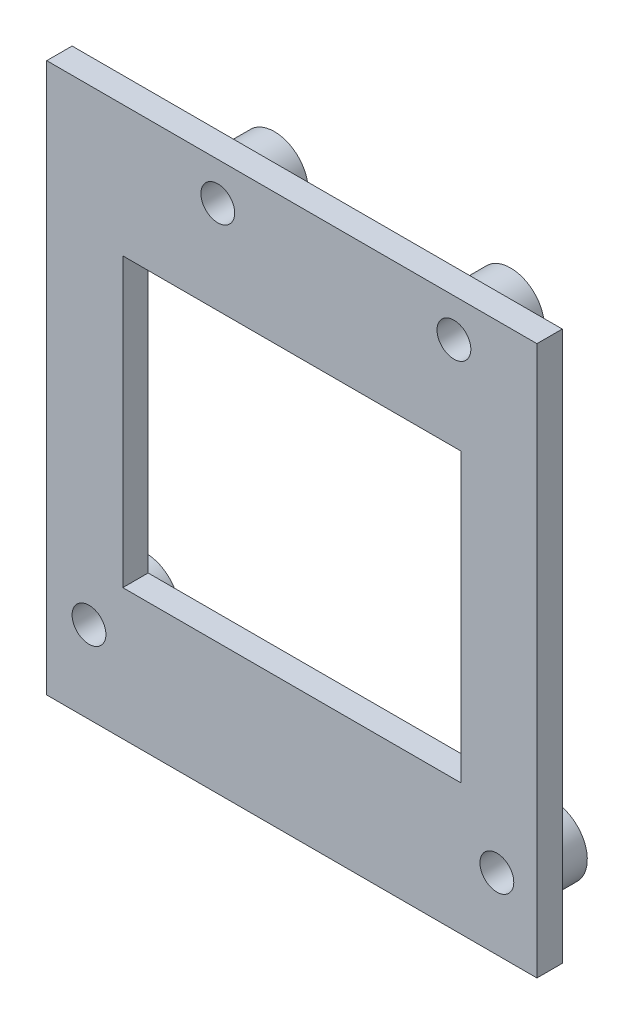
ISO-10303-21;
HEADER;
FILE_DESCRIPTION(('STEP AP214'),'2;1');
FILE_NAME('part.step','',(''),(''),'','','');
FILE_SCHEMA(('AUTOMOTIVE_DESIGN { 1 0 10303 214 1 1 1 1 }'));
ENDSEC;
DATA;
#1=APPLICATION_CONTEXT('core data for automotive mechanical design processes');
#2=APPLICATION_PROTOCOL_DEFINITION('international standard','automotive_design',2000,#1);
#3=PRODUCT_CONTEXT('',#1,'mechanical');
#4=PRODUCT('Part','Part','',(#3));
#5=PRODUCT_RELATED_PRODUCT_CATEGORY('part','',(#4));
#6=PRODUCT_DEFINITION_FORMATION('','',#4);
#7=PRODUCT_DEFINITION_CONTEXT('part definition',#1,'design');
#8=PRODUCT_DEFINITION('design','',#6,#7);
#9=PRODUCT_DEFINITION_SHAPE('','',#8);
#10=(LENGTH_UNIT() NAMED_UNIT(*) SI_UNIT(.MILLI.,.METRE.));
#11=(NAMED_UNIT(*) PLANE_ANGLE_UNIT() SI_UNIT($,.RADIAN.));
#12=(NAMED_UNIT(*) SI_UNIT($,.STERADIAN.) SOLID_ANGLE_UNIT());
#13=UNCERTAINTY_MEASURE_WITH_UNIT(LENGTH_MEASURE(1.E-05),#10,'distance_accuracy_value','');
#14=(GEOMETRIC_REPRESENTATION_CONTEXT(3) GLOBAL_UNCERTAINTY_ASSIGNED_CONTEXT((#13)) GLOBAL_UNIT_ASSIGNED_CONTEXT((#10,
#11,#12)) REPRESENTATION_CONTEXT('',''));
#15=CARTESIAN_POINT('',(0.,0.,0.));
#16=DIRECTION('',(0.,0.,1.));
#17=DIRECTION('',(1.,0.,0.));
#18=AXIS2_PLACEMENT_3D('',#15,#16,#17);
#19=CARTESIAN_POINT('',(17.,21.25,-3.001));
#20=DIRECTION('',(0.,0.,1.));
#21=DIRECTION('',(1.,0.,0.));
#22=AXIS2_PLACEMENT_3D('',#19,#20,#21);
#23=CYLINDRICAL_SURFACE('',#22,2.);
#24=CARTESIAN_POINT('',(17.,21.25,-6.7));
#25=DIRECTION('',(0.,0.,-1.));
#26=DIRECTION('',(-1.,0.,0.));
#27=AXIS2_PLACEMENT_3D('',#24,#25,#26);
#28=CIRCLE('',#27,2.);
#29=CARTESIAN_POINT('',(15.,21.25,-6.7));
#30=VERTEX_POINT('',#29);
#31=EDGE_CURVE('E379',#30,#30,#28,.T.);
#32=ORIENTED_EDGE('',*,*,#31,.T.);
#33=EDGE_LOOP('',(#32));
#34=FACE_BOUND('',#33,.T.);
#35=CARTESIAN_POINT('',(17.,21.25,-1.));
#36=DIRECTION('',(0.,0.,1.));
#37=DIRECTION('',(1.,0.,0.));
#38=AXIS2_PLACEMENT_3D('',#35,#36,#37);
#39=CIRCLE('',#38,2.);
#40=CARTESIAN_POINT('',(19.,21.25,-1.));
#41=VERTEX_POINT('',#40);
#42=EDGE_CURVE('E12',#41,#41,#39,.F.);
#43=ORIENTED_EDGE('',*,*,#42,.F.);
#44=EDGE_LOOP('',(#43));
#45=FACE_BOUND('',#44,.T.);
#46=ADVANCED_FACE('F42',(#34,#45),#23,.F.);
#47=CARTESIAN_POINT('',(17.,-26.25,-3.001));
#48=DIRECTION('',(0.,0.,1.));
#49=DIRECTION('',(1.,0.,0.));
#50=AXIS2_PLACEMENT_3D('',#47,#48,#49);
#51=CYLINDRICAL_SURFACE('',#50,2.);
#52=CARTESIAN_POINT('',(17.,-26.25,-6.7));
#53=DIRECTION('',(0.,0.,-1.));
#54=DIRECTION('',(-1.,0.,0.));
#55=AXIS2_PLACEMENT_3D('',#52,#53,#54);
#56=CIRCLE('',#55,2.);
#57=CARTESIAN_POINT('',(15.,-26.25,-6.7));
#58=VERTEX_POINT('',#57);
#59=EDGE_CURVE('E344',#58,#58,#56,.T.);
#60=ORIENTED_EDGE('',*,*,#59,.T.);
#61=EDGE_LOOP('',(#60));
#62=FACE_BOUND('',#61,.T.);
#63=CARTESIAN_POINT('',(17.,-26.25,-1.));
#64=DIRECTION('',(0.,0.,1.));
#65=DIRECTION('',(1.,0.,0.));
#66=AXIS2_PLACEMENT_3D('',#63,#64,#65);
#67=CIRCLE('',#66,2.);
#68=CARTESIAN_POINT('',(19.,-26.25,-1.));
#69=VERTEX_POINT('',#68);
#70=EDGE_CURVE('E50',#69,#69,#67,.F.);
#71=ORIENTED_EDGE('',*,*,#70,.F.);
#72=EDGE_LOOP('',(#71));
#73=FACE_BOUND('',#72,.T.);
#74=ADVANCED_FACE('F263',(#62,#73),#51,.F.);
#75=CARTESIAN_POINT('',(0.,-26.25,-3.001));
#76=DIRECTION('',(0.,0.,1.));
#77=DIRECTION('',(1.,0.,0.));
#78=AXIS2_PLACEMENT_3D('',#75,#76,#77);
#79=CYLINDRICAL_SURFACE('',#78,2.);
#80=CARTESIAN_POINT('',(0.,-26.25,-6.7));
#81=DIRECTION('',(0.,0.,-1.));
#82=DIRECTION('',(-1.,0.,0.));
#83=AXIS2_PLACEMENT_3D('',#80,#81,#82);
#84=CIRCLE('',#83,2.);
#85=CARTESIAN_POINT('',(-2.00000000000001,-26.25,-6.7));
#86=VERTEX_POINT('',#85);
#87=EDGE_CURVE('E349',#86,#86,#84,.T.);
#88=ORIENTED_EDGE('',*,*,#87,.T.);
#89=EDGE_LOOP('',(#88));
#90=FACE_BOUND('',#89,.T.);
#91=CARTESIAN_POINT('',(0.,-26.25,-1.));
#92=DIRECTION('',(0.,0.,1.));
#93=DIRECTION('',(1.,0.,0.));
#94=AXIS2_PLACEMENT_3D('',#91,#92,#93);
#95=CIRCLE('',#94,2.);
#96=CARTESIAN_POINT('',(1.99999999999999,-26.25,-1.));
#97=VERTEX_POINT('',#96);
#98=EDGE_CURVE('E256',#97,#97,#95,.F.);
#99=ORIENTED_EDGE('',*,*,#98,.F.);
#100=EDGE_LOOP('',(#99));
#101=FACE_BOUND('',#100,.T.);
#102=ADVANCED_FACE('F265',(#90,#101),#79,.F.);
#103=CARTESIAN_POINT('',(0.,21.25,-3.001));
#104=DIRECTION('',(0.,0.,1.));
#105=DIRECTION('',(1.,0.,0.));
#106=AXIS2_PLACEMENT_3D('',#103,#104,#105);
#107=CYLINDRICAL_SURFACE('',#106,2.);
#108=CARTESIAN_POINT('',(0.,21.25,-6.7));
#109=DIRECTION('',(0.,0.,-1.));
#110=DIRECTION('',(-1.,0.,0.));
#111=AXIS2_PLACEMENT_3D('',#108,#109,#110);
#112=CIRCLE('',#111,2.);
#113=CARTESIAN_POINT('',(-2.,21.25,-6.7));
#114=VERTEX_POINT('',#113);
#115=EDGE_CURVE('E373',#114,#114,#112,.T.);
#116=ORIENTED_EDGE('',*,*,#115,.T.);
#117=EDGE_LOOP('',(#116));
#118=FACE_BOUND('',#117,.T.);
#119=CARTESIAN_POINT('',(0.,21.25,-1.));
#120=DIRECTION('',(0.,0.,1.));
#121=DIRECTION('',(1.,0.,0.));
#122=AXIS2_PLACEMENT_3D('',#119,#120,#121);
#123=CIRCLE('',#122,2.);
#124=CARTESIAN_POINT('',(2.,21.25,-1.));
#125=VERTEX_POINT('',#124);
#126=EDGE_CURVE('E253',#125,#125,#123,.F.);
#127=ORIENTED_EDGE('',*,*,#126,.F.);
#128=EDGE_LOOP('',(#127));
#129=FACE_BOUND('',#128,.T.);
#130=ADVANCED_FACE('F272',(#118,#129),#107,.F.);
#131=CARTESIAN_POINT('',(-17.,-26.25,-3.001));
#132=DIRECTION('',(0.,0.,1.));
#133=DIRECTION('',(1.,0.,0.));
#134=AXIS2_PLACEMENT_3D('',#131,#132,#133);
#135=CYLINDRICAL_SURFACE('',#134,2.);
#136=CARTESIAN_POINT('',(-17.,-26.25,-6.7));
#137=DIRECTION('',(0.,0.,-1.));
#138=DIRECTION('',(-1.,0.,0.));
#139=AXIS2_PLACEMENT_3D('',#136,#137,#138);
#140=CIRCLE('',#139,2.);
#141=CARTESIAN_POINT('',(-19.,-26.25,-6.7));
#142=VERTEX_POINT('',#141);
#143=EDGE_CURVE('E355',#142,#142,#140,.T.);
#144=ORIENTED_EDGE('',*,*,#143,.T.);
#145=EDGE_LOOP('',(#144));
#146=FACE_BOUND('',#145,.T.);
#147=CARTESIAN_POINT('',(-17.,-26.25,-1.));
#148=DIRECTION('',(0.,0.,1.));
#149=DIRECTION('',(1.,0.,0.));
#150=AXIS2_PLACEMENT_3D('',#147,#148,#149);
#151=CIRCLE('',#150,2.);
#152=CARTESIAN_POINT('',(-15.,-26.25,-1.));
#153=VERTEX_POINT('',#152);
#154=EDGE_CURVE('E250',#153,#153,#151,.F.);
#155=ORIENTED_EDGE('',*,*,#154,.F.);
#156=EDGE_LOOP('',(#155));
#157=FACE_BOUND('',#156,.T.);
#158=ADVANCED_FACE('F281',(#146,#157),#135,.F.);
#159=CARTESIAN_POINT('',(-17.,21.25,-3.001));
#160=DIRECTION('',(0.,0.,1.));
#161=DIRECTION('',(1.,0.,0.));
#162=AXIS2_PLACEMENT_3D('',#159,#160,#161);
#163=CYLINDRICAL_SURFACE('',#162,2.);
#164=CARTESIAN_POINT('',(-17.,21.25,-6.7));
#165=DIRECTION('',(0.,0.,-1.));
#166=DIRECTION('',(-1.,0.,0.));
#167=AXIS2_PLACEMENT_3D('',#164,#165,#166);
#168=CIRCLE('',#167,2.);
#169=CARTESIAN_POINT('',(-19.,21.25,-6.7));
#170=VERTEX_POINT('',#169);
#171=EDGE_CURVE('E367',#170,#170,#168,.T.);
#172=ORIENTED_EDGE('',*,*,#171,.T.);
#173=EDGE_LOOP('',(#172));
#174=FACE_BOUND('',#173,.T.);
#175=CARTESIAN_POINT('',(-17.,21.25,-1.));
#176=DIRECTION('',(0.,0.,1.));
#177=DIRECTION('',(1.,0.,0.));
#178=AXIS2_PLACEMENT_3D('',#175,#176,#177);
#179=CIRCLE('',#178,2.);
#180=CARTESIAN_POINT('',(-15.,21.25,-1.));
#181=VERTEX_POINT('',#180);
#182=EDGE_CURVE('E247',#181,#181,#179,.F.);
#183=ORIENTED_EDGE('',*,*,#182,.F.);
#184=EDGE_LOOP('',(#183));
#185=FACE_BOUND('',#184,.T.);
#186=ADVANCED_FACE('F284',(#174,#185),#163,.F.);
#187=CARTESIAN_POINT('',(0.,0.,-3.));
#188=DIRECTION('',(0.,0.,1.));
#189=DIRECTION('',(1.,0.,0.));
#190=AXIS2_PLACEMENT_3D('',#187,#188,#189);
#191=PLANE('',#190);
#192=CARTESIAN_POINT('',(0.,-26.25,-3.));
#193=DIRECTION('',(0.,0.,1.));
#194=DIRECTION('',(1.,0.,0.));
#195=AXIS2_PLACEMENT_3D('',#192,#193,#194);
#196=CIRCLE('',#195,4.);
#197=CARTESIAN_POINT('',(3.99999999999999,-26.25,-3.));
#198=VERTEX_POINT('',#197);
#199=EDGE_CURVE('E244',#198,#198,#196,.F.);
#200=ORIENTED_EDGE('',*,*,#199,.F.);
#201=EDGE_LOOP('',(#200));
#202=FACE_BOUND('',#201,.T.);
#203=CARTESIAN_POINT('',(-17.,21.25,-3.));
#204=DIRECTION('',(0.,0.,1.));
#205=DIRECTION('',(1.,0.,0.));
#206=AXIS2_PLACEMENT_3D('',#203,#204,#205);
#207=CIRCLE('',#206,4.);
#208=CARTESIAN_POINT('',(-13.,21.25,-3.));
#209=VERTEX_POINT('',#208);
#210=EDGE_CURVE('E241',#209,#209,#207,.F.);
#211=ORIENTED_EDGE('',*,*,#210,.F.);
#212=EDGE_LOOP('',(#211));
#213=FACE_BOUND('',#212,.T.);
#214=CARTESIAN_POINT('',(17.,21.25,-3.));
#215=DIRECTION('',(0.,0.,-1.));
#216=DIRECTION('',(-1.,0.,0.));
#217=AXIS2_PLACEMENT_3D('',#214,#215,#216);
#218=CIRCLE('',#217,4.);
#219=CARTESIAN_POINT('',(19.8501490997706,24.0565370314815,-3.));
#220=VERTEX_POINT('',#219);
#221=CARTESIAN_POINT('',(16.3298509002294,25.1934629685185,-3.));
#222=VERTEX_POINT('',#221);
#223=EDGE_CURVE('E382',#220,#222,#218,.T.);
#224=ORIENTED_EDGE('',*,*,#223,.F.);
#225=CARTESIAN_POINT('',(19.18,28.,-3.));
#226=DIRECTION('',(0.,0.,1.));
#227=DIRECTION('',(1.,0.,0.));
#228=AXIS2_PLACEMENT_3D('',#225,#226,#227);
#229=CIRCLE('',#228,4.);
#230=EDGE_CURVE('E185',#220,#222,#229,.T.);
#231=ORIENTED_EDGE('',*,*,#230,.T.);
#232=EDGE_LOOP('',(#224,#231));
#233=FACE_BOUND('',#232,.T.);
#234=DIRECTION('',(-1.,0.,0.));
#235=VECTOR('',#234,1.);
#236=CARTESIAN_POINT('',(-20.,-17.,-3.));
#237=LINE('',#236,#235);
#238=CARTESIAN_POINT('',(20.,-17.,-3.));
#239=VERTEX_POINT('',#238);
#240=CARTESIAN_POINT('',(-20.,-17.,-3.));
#241=VERTEX_POINT('',#240);
#242=EDGE_CURVE('E395',#239,#241,#237,.T.);
#243=ORIENTED_EDGE('',*,*,#242,.F.);
#244=DIRECTION('',(0.,-1.,0.));
#245=VECTOR('',#244,1.);
#246=CARTESIAN_POINT('',(20.,17.,-3.));
#247=LINE('',#246,#245);
#248=CARTESIAN_POINT('',(20.,17.,-3.));
#249=VERTEX_POINT('',#248);
#250=EDGE_CURVE('E398',#249,#239,#247,.T.);
#251=ORIENTED_EDGE('',*,*,#250,.F.);
#252=DIRECTION('',(1.,0.,0.));
#253=VECTOR('',#252,1.);
#254=CARTESIAN_POINT('',(-20.,17.,-3.));
#255=LINE('',#254,#253);
#256=CARTESIAN_POINT('',(-20.,17.,-3.));
#257=VERTEX_POINT('',#256);
#258=EDGE_CURVE('E165',#257,#249,#255,.T.);
#259=ORIENTED_EDGE('',*,*,#258,.F.);
#260=DIRECTION('',(0.,1.,0.));
#261=VECTOR('',#260,1.);
#262=CARTESIAN_POINT('',(-20.,17.,-3.));
#263=LINE('',#262,#261);
#264=EDGE_CURVE('E393',#241,#257,#263,.T.);
#265=ORIENTED_EDGE('',*,*,#264,.F.);
#266=EDGE_LOOP('',(#243,#251,#259,#265));
#267=FACE_BOUND('',#266,.T.);
#268=CARTESIAN_POINT('',(-8.76000000000001,28.,-3.));
#269=DIRECTION('',(0.,0.,1.));
#270=DIRECTION('',(1.,0.,0.));
#271=AXIS2_PLACEMENT_3D('',#268,#269,#270);
#272=CIRCLE('',#271,4.);
#273=CARTESIAN_POINT('',(-4.76000000000001,28.,-3.));
#274=VERTEX_POINT('',#273);
#275=EDGE_CURVE('E191',#274,#274,#272,.T.);
#276=ORIENTED_EDGE('',*,*,#275,.T.);
#277=EDGE_LOOP('',(#276));
#278=FACE_BOUND('',#277,.T.);
#279=DIRECTION('',(0.,1.,0.));
#280=VECTOR('',#279,1.);
#281=CARTESIAN_POINT('',(29.,32.5,-3.));
#282=LINE('',#281,#280);
#283=CARTESIAN_POINT('',(29.,-32.5,-3.));
#284=VERTEX_POINT('',#283);
#285=CARTESIAN_POINT('',(29.,32.5,-3.));
#286=VERTEX_POINT('',#285);
#287=EDGE_CURVE('E207',#284,#286,#282,.T.);
#288=ORIENTED_EDGE('',*,*,#287,.F.);
#289=DIRECTION('',(1.,0.,0.));
#290=VECTOR('',#289,1.);
#291=CARTESIAN_POINT('',(-29.,-32.5,-3.));
#292=LINE('',#291,#290);
#293=CARTESIAN_POINT('',(-29.,-32.5,-3.));
#294=VERTEX_POINT('',#293);
#295=EDGE_CURVE('E217',#294,#284,#292,.T.);
#296=ORIENTED_EDGE('',*,*,#295,.F.);
#297=DIRECTION('',(0.,-1.,0.));
#298=VECTOR('',#297,1.);
#299=CARTESIAN_POINT('',(-29.,32.5,-3.));
#300=LINE('',#299,#298);
#301=CARTESIAN_POINT('',(-29.,32.5,-3.));
#302=VERTEX_POINT('',#301);
#303=EDGE_CURVE('E214',#302,#294,#300,.T.);
#304=ORIENTED_EDGE('',*,*,#303,.F.);
#305=DIRECTION('',(-1.,0.,0.));
#306=VECTOR('',#305,1.);
#307=CARTESIAN_POINT('',(-29.,32.5,-3.));
#308=LINE('',#307,#306);
#309=EDGE_CURVE('E210',#286,#302,#308,.T.);
#310=ORIENTED_EDGE('',*,*,#309,.F.);
#311=EDGE_LOOP('',(#288,#296,#304,#310));
#312=FACE_BOUND('',#311,.T.);
#313=CARTESIAN_POINT('',(0.,21.25,-3.));
#314=DIRECTION('',(0.,0.,1.));
#315=DIRECTION('',(1.,0.,0.));
#316=AXIS2_PLACEMENT_3D('',#313,#314,#315);
#317=CIRCLE('',#316,4.);
#318=CARTESIAN_POINT('',(4.,21.25,-3.));
#319=VERTEX_POINT('',#318);
#320=EDGE_CURVE('E233',#319,#319,#317,.F.);
#321=ORIENTED_EDGE('',*,*,#320,.F.);
#322=EDGE_LOOP('',(#321));
#323=FACE_BOUND('',#322,.T.);
#324=CARTESIAN_POINT('',(-17.,-26.25,-3.));
#325=DIRECTION('',(0.,0.,-1.));
#326=DIRECTION('',(-1.,0.,0.));
#327=AXIS2_PLACEMENT_3D('',#324,#325,#326);
#328=CIRCLE('',#327,4.);
#329=CARTESIAN_POINT('',(-20.1109752818749,-23.7356744849635,-3.));
#330=VERTEX_POINT('',#329);
#331=CARTESIAN_POINT('',(-20.8890247181251,-25.3143255150365,-3.));
#332=VERTEX_POINT('',#331);
#333=EDGE_CURVE('E65',#330,#332,#328,.T.);
#334=ORIENTED_EDGE('',*,*,#333,.F.);
#335=CARTESIAN_POINT('',(-24.,-22.8,-3.));
#336=DIRECTION('',(0.,0.,1.));
#337=DIRECTION('',(1.,0.,0.));
#338=AXIS2_PLACEMENT_3D('',#335,#336,#337);
#339=CIRCLE('',#338,4.);
#340=EDGE_CURVE('E174',#330,#332,#339,.T.);
#341=ORIENTED_EDGE('',*,*,#340,.T.);
#342=EDGE_LOOP('',(#334,#341));
#343=FACE_BOUND('',#342,.T.);
#344=CARTESIAN_POINT('',(17.,-26.25,-3.));
#345=DIRECTION('',(0.,0.,-1.));
#346=DIRECTION('',(-1.,0.,0.));
#347=AXIS2_PLACEMENT_3D('',#344,#345,#346);
#348=CIRCLE('',#347,4.);
#349=CARTESIAN_POINT('',(20.9977329631625,-26.3846519782386,-3.));
#350=VERTEX_POINT('',#349);
#351=CARTESIAN_POINT('',(20.2622670368375,-23.9353480217614,-3.));
#352=VERTEX_POINT('',#351);
#353=EDGE_CURVE('E57',#350,#352,#348,.T.);
#354=ORIENTED_EDGE('',*,*,#353,.F.);
#355=CARTESIAN_POINT('',(24.26,-24.07,-3.));
#356=DIRECTION('',(0.,0.,1.));
#357=DIRECTION('',(1.,0.,0.));
#358=AXIS2_PLACEMENT_3D('',#355,#356,#357);
#359=CIRCLE('',#358,4.);
#360=EDGE_CURVE('E180',#350,#352,#359,.T.);
#361=ORIENTED_EDGE('',*,*,#360,.T.);
#362=EDGE_LOOP('',(#354,#361));
#363=FACE_BOUND('',#362,.T.);
#364=ADVANCED_FACE('F287',(#202,#213,#233,#267,#278,#312,#323,#343,#363),#191,.F.);
#365=CARTESIAN_POINT('',(24.26,-24.07,-5.7));
#366=DIRECTION('',(0.,0.,1.));
#367=DIRECTION('',(1.,0.,0.));
#368=AXIS2_PLACEMENT_3D('',#365,#366,#367);
#369=CYLINDRICAL_SURFACE('',#368,4.);
#370=ORIENTED_EDGE('',*,*,#360,.F.);
#371=DIRECTION('',(0.,0.,1.));
#372=VECTOR('',#371,1.);
#373=CARTESIAN_POINT('',(20.9977329631625,-26.3846519782386,-4.85));
#374=LINE('',#373,#372);
#375=CARTESIAN_POINT('',(20.9977329631625,-26.3846519782386,-6.7));
#376=VERTEX_POINT('',#375);
#377=EDGE_CURVE('E149',#350,#376,#374,.F.);
#378=ORIENTED_EDGE('',*,*,#377,.T.);
#379=CARTESIAN_POINT('',(24.26,-24.07,-6.7));
#380=DIRECTION('',(0.,0.,-1.));
#381=DIRECTION('',(-1.,0.,0.));
#382=AXIS2_PLACEMENT_3D('',#379,#380,#381);
#383=CIRCLE('',#382,4.);
#384=CARTESIAN_POINT('',(20.2622670368375,-23.9353480217614,-6.7));
#385=VERTEX_POINT('',#384);
#386=EDGE_CURVE('E155',#385,#376,#383,.T.);
#387=ORIENTED_EDGE('',*,*,#386,.F.);
#388=DIRECTION('',(0.,0.,1.));
#389=VECTOR('',#388,1.);
#390=CARTESIAN_POINT('',(20.2622670368375,-23.9353480217614,-4.85));
#391=LINE('',#390,#389);
#392=EDGE_CURVE('E140',#385,#352,#391,.T.);
#393=ORIENTED_EDGE('',*,*,#392,.T.);
#394=EDGE_LOOP('',(#370,#378,#387,#393));
#395=FACE_BOUND('',#394,.T.);
#396=ADVANCED_FACE('F157',(#395),#369,.T.);
#397=CARTESIAN_POINT('',(-24.,-22.8,-5.7));
#398=DIRECTION('',(0.,0.,1.));
#399=DIRECTION('',(1.,0.,0.));
#400=AXIS2_PLACEMENT_3D('',#397,#398,#399);
#401=CYLINDRICAL_SURFACE('',#400,4.);
#402=ORIENTED_EDGE('',*,*,#340,.F.);
#403=DIRECTION('',(0.,0.,1.));
#404=VECTOR('',#403,1.);
#405=CARTESIAN_POINT('',(-20.1109752818749,-23.7356744849635,-4.85));
#406=LINE('',#405,#404);
#407=CARTESIAN_POINT('',(-20.1109752818749,-23.7356744849635,-6.7));
#408=VERTEX_POINT('',#407);
#409=EDGE_CURVE('E364',#330,#408,#406,.F.);
#410=ORIENTED_EDGE('',*,*,#409,.T.);
#411=CARTESIAN_POINT('',(-24.,-22.8,-6.7));
#412=DIRECTION('',(0.,0.,-1.));
#413=DIRECTION('',(-1.,0.,0.));
#414=AXIS2_PLACEMENT_3D('',#411,#412,#413);
#415=CIRCLE('',#414,4.);
#416=CARTESIAN_POINT('',(-20.8890247181251,-25.3143255150365,-6.7));
#417=VERTEX_POINT('',#416);
#418=EDGE_CURVE('E162',#417,#408,#415,.T.);
#419=ORIENTED_EDGE('',*,*,#418,.F.);
#420=DIRECTION('',(0.,0.,1.));
#421=VECTOR('',#420,1.);
#422=CARTESIAN_POINT('',(-20.8890247181251,-25.3143255150365,-4.85));
#423=LINE('',#422,#421);
#424=EDGE_CURVE('E361',#417,#332,#423,.T.);
#425=ORIENTED_EDGE('',*,*,#424,.T.);
#426=EDGE_LOOP('',(#402,#410,#419,#425));
#427=FACE_BOUND('',#426,.T.);
#428=ADVANCED_FACE('F485',(#427),#401,.T.);
#429=CARTESIAN_POINT('',(19.18,28.,-5.7));
#430=DIRECTION('',(0.,0.,1.));
#431=DIRECTION('',(1.,0.,0.));
#432=AXIS2_PLACEMENT_3D('',#429,#430,#431);
#433=CYLINDRICAL_SURFACE('',#432,4.);
#434=ORIENTED_EDGE('',*,*,#230,.F.);
#435=DIRECTION('',(0.,0.,1.));
#436=VECTOR('',#435,1.);
#437=CARTESIAN_POINT('',(19.8501490997706,24.0565370314815,-4.85));
#438=LINE('',#437,#436);
#439=CARTESIAN_POINT('',(19.8501490997706,24.0565370314815,-6.7));
#440=VERTEX_POINT('',#439);
#441=EDGE_CURVE('E390',#220,#440,#438,.F.);
#442=ORIENTED_EDGE('',*,*,#441,.T.);
#443=CARTESIAN_POINT('',(19.18,28.,-6.7));
#444=DIRECTION('',(0.,0.,-1.));
#445=DIRECTION('',(-1.,0.,0.));
#446=AXIS2_PLACEMENT_3D('',#443,#444,#445);
#447=CIRCLE('',#446,4.);
#448=CARTESIAN_POINT('',(16.3298509002294,25.1934629685185,-6.7));
#449=VERTEX_POINT('',#448);
#450=EDGE_CURVE('E159',#449,#440,#447,.T.);
#451=ORIENTED_EDGE('',*,*,#450,.F.);
#452=DIRECTION('',(0.,0.,1.));
#453=VECTOR('',#452,1.);
#454=CARTESIAN_POINT('',(16.3298509002294,25.1934629685185,-4.85));
#455=LINE('',#454,#453);
#456=EDGE_CURVE('E386',#449,#222,#455,.T.);
#457=ORIENTED_EDGE('',*,*,#456,.T.);
#458=EDGE_LOOP('',(#434,#442,#451,#457));
#459=FACE_BOUND('',#458,.T.);
#460=ADVANCED_FACE('F488',(#459),#433,.T.);
#461=CARTESIAN_POINT('',(29.,32.5,-3.));
#462=DIRECTION('',(1.,0.,0.));
#463=DIRECTION('',(0.,1.,0.));
#464=AXIS2_PLACEMENT_3D('',#461,#462,#463);
#465=PLANE('',#464);
#466=DIRECTION('',(0.,1.,0.));
#467=VECTOR('',#466,1.);
#468=CARTESIAN_POINT('',(29.,32.5,0.));
#469=LINE('',#468,#467);
#470=CARTESIAN_POINT('',(29.,-32.5,0.));
#471=VERTEX_POINT('',#470);
#472=CARTESIAN_POINT('',(29.,32.5,0.));
#473=VERTEX_POINT('',#472);
#474=EDGE_CURVE('E206',#471,#473,#469,.T.);
#475=ORIENTED_EDGE('',*,*,#474,.F.);
#476=DIRECTION('',(0.,0.,1.));
#477=VECTOR('',#476,1.);
#478=CARTESIAN_POINT('',(29.,-32.5,-3.));
#479=LINE('',#478,#477);
#480=EDGE_CURVE('E231',#284,#471,#479,.T.);
#481=ORIENTED_EDGE('',*,*,#480,.F.);
#482=ORIENTED_EDGE('',*,*,#287,.T.);
#483=DIRECTION('',(0.,0.,1.));
#484=VECTOR('',#483,1.);
#485=CARTESIAN_POINT('',(29.,32.5,-3.));
#486=LINE('',#485,#484);
#487=EDGE_CURVE('E220',#286,#473,#486,.T.);
#488=ORIENTED_EDGE('',*,*,#487,.T.);
#489=EDGE_LOOP('',(#475,#481,#482,#488));
#490=FACE_BOUND('',#489,.T.);
#491=ADVANCED_FACE('F44',(#490),#465,.T.);
#492=CARTESIAN_POINT('',(-29.,-32.5,-3.));
#493=DIRECTION('',(0.,-1.,0.));
#494=DIRECTION('',(0.,0.,-1.));
#495=AXIS2_PLACEMENT_3D('',#492,#493,#494);
#496=PLANE('',#495);
#497=DIRECTION('',(1.,0.,0.));
#498=VECTOR('',#497,1.);
#499=CARTESIAN_POINT('',(-29.,-32.5,0.));
#500=LINE('',#499,#498);
#501=CARTESIAN_POINT('',(-29.,-32.5,0.));
#502=VERTEX_POINT('',#501);
#503=EDGE_CURVE('E211',#502,#471,#500,.T.);
#504=ORIENTED_EDGE('',*,*,#503,.F.);
#505=DIRECTION('',(0.,0.,1.));
#506=VECTOR('',#505,1.);
#507=CARTESIAN_POINT('',(-29.,-32.5,-3.));
#508=LINE('',#507,#506);
#509=EDGE_CURVE('E234',#294,#502,#508,.T.);
#510=ORIENTED_EDGE('',*,*,#509,.F.);
#511=ORIENTED_EDGE('',*,*,#295,.T.);
#512=ORIENTED_EDGE('',*,*,#480,.T.);
#513=EDGE_LOOP('',(#504,#510,#511,#512));
#514=FACE_BOUND('',#513,.T.);
#515=ADVANCED_FACE('F317',(#514),#496,.T.);
#516=CARTESIAN_POINT('',(-29.,32.5,-3.));
#517=DIRECTION('',(-1.,0.,0.));
#518=DIRECTION('',(0.,-1.,0.));
#519=AXIS2_PLACEMENT_3D('',#516,#517,#518);
#520=PLANE('',#519);
#521=DIRECTION('',(0.,-1.,0.));
#522=VECTOR('',#521,1.);
#523=CARTESIAN_POINT('',(-29.,32.5,0.));
#524=LINE('',#523,#522);
#525=CARTESIAN_POINT('',(-29.,32.5,0.));
#526=VERTEX_POINT('',#525);
#527=EDGE_CURVE('E226',#526,#502,#524,.T.);
#528=ORIENTED_EDGE('',*,*,#527,.F.);
#529=DIRECTION('',(0.,0.,1.));
#530=VECTOR('',#529,1.);
#531=CARTESIAN_POINT('',(-29.,32.5,-3.));
#532=LINE('',#531,#530);
#533=EDGE_CURVE('E236',#302,#526,#532,.T.);
#534=ORIENTED_EDGE('',*,*,#533,.F.);
#535=ORIENTED_EDGE('',*,*,#303,.T.);
#536=ORIENTED_EDGE('',*,*,#509,.T.);
#537=EDGE_LOOP('',(#528,#534,#535,#536));
#538=FACE_BOUND('',#537,.T.);
#539=ADVANCED_FACE('F320',(#538),#520,.T.);
#540=CARTESIAN_POINT('',(-29.,32.5,-3.));
#541=DIRECTION('',(0.,1.,0.));
#542=DIRECTION('',(0.,0.,1.));
#543=AXIS2_PLACEMENT_3D('',#540,#541,#542);
#544=PLANE('',#543);
#545=DIRECTION('',(-1.,0.,0.));
#546=VECTOR('',#545,1.);
#547=CARTESIAN_POINT('',(-29.,32.5,0.));
#548=LINE('',#547,#546);
#549=EDGE_CURVE('E223',#473,#526,#548,.T.);
#550=ORIENTED_EDGE('',*,*,#549,.F.);
#551=ORIENTED_EDGE('',*,*,#487,.F.);
#552=ORIENTED_EDGE('',*,*,#309,.T.);
#553=ORIENTED_EDGE('',*,*,#533,.T.);
#554=EDGE_LOOP('',(#550,#551,#552,#553));
#555=FACE_BOUND('',#554,.T.);
#556=ADVANCED_FACE('F315',(#555),#544,.T.);
#557=CARTESIAN_POINT('',(0.,0.,0.));
#558=DIRECTION('',(0.,0.,1.));
#559=DIRECTION('',(1.,0.,0.));
#560=AXIS2_PLACEMENT_3D('',#557,#558,#559);
#561=PLANE('',#560);
#562=DIRECTION('',(0.,1.,0.));
#563=VECTOR('',#562,1.);
#564=CARTESIAN_POINT('',(20.,17.,0.));
#565=LINE('',#564,#563);
#566=CARTESIAN_POINT('',(20.,-17.,0.));
#567=VERTEX_POINT('',#566);
#568=CARTESIAN_POINT('',(20.,17.,0.));
#569=VERTEX_POINT('',#568);
#570=EDGE_CURVE('E401',#567,#569,#565,.T.);
#571=ORIENTED_EDGE('',*,*,#570,.F.);
#572=DIRECTION('',(1.,0.,0.));
#573=VECTOR('',#572,1.);
#574=CARTESIAN_POINT('',(-20.,-17.,0.));
#575=LINE('',#574,#573);
#576=CARTESIAN_POINT('',(-20.,-17.,0.));
#577=VERTEX_POINT('',#576);
#578=EDGE_CURVE('E409',#577,#567,#575,.T.);
#579=ORIENTED_EDGE('',*,*,#578,.F.);
#580=DIRECTION('',(0.,-1.,0.));
#581=VECTOR('',#580,1.);
#582=CARTESIAN_POINT('',(-20.,17.,0.));
#583=LINE('',#582,#581);
#584=CARTESIAN_POINT('',(-20.,17.,0.));
#585=VERTEX_POINT('',#584);
#586=EDGE_CURVE('E406',#585,#577,#583,.T.);
#587=ORIENTED_EDGE('',*,*,#586,.F.);
#588=DIRECTION('',(-1.,0.,0.));
#589=VECTOR('',#588,1.);
#590=CARTESIAN_POINT('',(-20.,17.,0.));
#591=LINE('',#590,#589);
#592=EDGE_CURVE('E403',#569,#585,#591,.T.);
#593=ORIENTED_EDGE('',*,*,#592,.F.);
#594=EDGE_LOOP('',(#571,#579,#587,#593));
#595=FACE_BOUND('',#594,.T.);
#596=CARTESIAN_POINT('',(24.26,-24.07,0.));
#597=DIRECTION('',(0.,0.,1.));
#598=DIRECTION('',(1.,0.,0.));
#599=AXIS2_PLACEMENT_3D('',#596,#597,#598);
#600=CIRCLE('',#599,2.);
#601=CARTESIAN_POINT('',(26.26,-24.07,0.));
#602=VERTEX_POINT('',#601);
#603=EDGE_CURVE('E194',#602,#602,#600,.T.);
#604=ORIENTED_EDGE('',*,*,#603,.F.);
#605=EDGE_LOOP('',(#604));
#606=FACE_BOUND('',#605,.T.);
#607=CARTESIAN_POINT('',(-24.,-22.8,0.));
#608=DIRECTION('',(0.,0.,1.));
#609=DIRECTION('',(1.,0.,0.));
#610=AXIS2_PLACEMENT_3D('',#607,#608,#609);
#611=CIRCLE('',#610,2.);
#612=CARTESIAN_POINT('',(-22.,-22.8,0.));
#613=VERTEX_POINT('',#612);
#614=EDGE_CURVE('E199',#613,#613,#611,.T.);
#615=ORIENTED_EDGE('',*,*,#614,.F.);
#616=EDGE_LOOP('',(#615));
#617=FACE_BOUND('',#616,.T.);
#618=CARTESIAN_POINT('',(19.18,28.,0.));
#619=DIRECTION('',(0.,0.,1.));
#620=DIRECTION('',(1.,0.,0.));
#621=AXIS2_PLACEMENT_3D('',#618,#619,#620);
#622=CIRCLE('',#621,2.);
#623=CARTESIAN_POINT('',(21.18,28.,0.));
#624=VERTEX_POINT('',#623);
#625=EDGE_CURVE('E195',#624,#624,#622,.T.);
#626=ORIENTED_EDGE('',*,*,#625,.F.);
#627=EDGE_LOOP('',(#626));
#628=FACE_BOUND('',#627,.T.);
#629=CARTESIAN_POINT('',(-8.76000000000001,28.,0.));
#630=DIRECTION('',(0.,0.,1.));
#631=DIRECTION('',(1.,0.,0.));
#632=AXIS2_PLACEMENT_3D('',#629,#630,#631);
#633=CIRCLE('',#632,2.);
#634=CARTESIAN_POINT('',(-6.76000000000001,28.,0.));
#635=VERTEX_POINT('',#634);
#636=EDGE_CURVE('E198',#635,#635,#633,.T.);
#637=ORIENTED_EDGE('',*,*,#636,.F.);
#638=EDGE_LOOP('',(#637));
#639=FACE_BOUND('',#638,.T.);
#640=ORIENTED_EDGE('',*,*,#474,.T.);
#641=ORIENTED_EDGE('',*,*,#549,.T.);
#642=ORIENTED_EDGE('',*,*,#527,.T.);
#643=ORIENTED_EDGE('',*,*,#503,.T.);
#644=EDGE_LOOP('',(#640,#641,#642,#643));
#645=FACE_BOUND('',#644,.T.);
#646=ADVANCED_FACE('F308',(#595,#606,#617,#628,#639,#645),#561,.T.);
#647=CARTESIAN_POINT('',(-8.76000000000001,28.,-3.001));
#648=DIRECTION('',(0.,0.,1.));
#649=DIRECTION('',(1.,0.,0.));
#650=AXIS2_PLACEMENT_3D('',#647,#648,#649);
#651=CYLINDRICAL_SURFACE('',#650,2.);
#652=ORIENTED_EDGE('',*,*,#636,.T.);
#653=EDGE_LOOP('',(#652));
#654=FACE_BOUND('',#653,.T.);
#655=CARTESIAN_POINT('',(-8.76000000000001,28.,-5.7));
#656=DIRECTION('',(0.,0.,1.));
#657=DIRECTION('',(1.,0.,0.));
#658=AXIS2_PLACEMENT_3D('',#655,#656,#657);
#659=CIRCLE('',#658,2.);
#660=CARTESIAN_POINT('',(-6.76000000000001,28.,-5.7));
#661=VERTEX_POINT('',#660);
#662=EDGE_CURVE('E188',#661,#661,#659,.T.);
#663=ORIENTED_EDGE('',*,*,#662,.F.);
#664=EDGE_LOOP('',(#663));
#665=FACE_BOUND('',#664,.T.);
#666=ADVANCED_FACE('F296',(#654,#665),#651,.F.);
#667=CARTESIAN_POINT('',(19.18,28.,-3.001));
#668=DIRECTION('',(0.,0.,1.));
#669=DIRECTION('',(1.,0.,0.));
#670=AXIS2_PLACEMENT_3D('',#667,#668,#669);
#671=CYLINDRICAL_SURFACE('',#670,2.);
#672=ORIENTED_EDGE('',*,*,#625,.T.);
#673=EDGE_LOOP('',(#672));
#674=FACE_BOUND('',#673,.T.);
#675=CARTESIAN_POINT('',(19.18,28.,-5.7));
#676=DIRECTION('',(0.,0.,1.));
#677=DIRECTION('',(1.,0.,0.));
#678=AXIS2_PLACEMENT_3D('',#675,#676,#677);
#679=CIRCLE('',#678,2.);
#680=CARTESIAN_POINT('',(21.18,28.,-5.7));
#681=VERTEX_POINT('',#680);
#682=EDGE_CURVE('E182',#681,#681,#679,.T.);
#683=ORIENTED_EDGE('',*,*,#682,.F.);
#684=EDGE_LOOP('',(#683));
#685=FACE_BOUND('',#684,.T.);
#686=ADVANCED_FACE('F292',(#674,#685),#671,.F.);
#687=CARTESIAN_POINT('',(-24.,-22.8,-3.001));
#688=DIRECTION('',(0.,0.,1.));
#689=DIRECTION('',(1.,0.,0.));
#690=AXIS2_PLACEMENT_3D('',#687,#688,#689);
#691=CYLINDRICAL_SURFACE('',#690,2.);
#692=ORIENTED_EDGE('',*,*,#614,.T.);
#693=EDGE_LOOP('',(#692));
#694=FACE_BOUND('',#693,.T.);
#695=CARTESIAN_POINT('',(-24.,-22.8,-5.7));
#696=DIRECTION('',(0.,0.,1.));
#697=DIRECTION('',(1.,0.,0.));
#698=AXIS2_PLACEMENT_3D('',#695,#696,#697);
#699=CIRCLE('',#698,2.);
#700=CARTESIAN_POINT('',(-22.,-22.8,-5.7));
#701=VERTEX_POINT('',#700);
#702=EDGE_CURVE('E171',#701,#701,#699,.T.);
#703=ORIENTED_EDGE('',*,*,#702,.F.);
#704=EDGE_LOOP('',(#703));
#705=FACE_BOUND('',#704,.T.);
#706=ADVANCED_FACE('F295',(#694,#705),#691,.F.);
#707=CARTESIAN_POINT('',(24.26,-24.07,-3.001));
#708=DIRECTION('',(0.,0.,1.));
#709=DIRECTION('',(1.,0.,0.));
#710=AXIS2_PLACEMENT_3D('',#707,#708,#709);
#711=CYLINDRICAL_SURFACE('',#710,2.);
#712=ORIENTED_EDGE('',*,*,#603,.T.);
#713=EDGE_LOOP('',(#712));
#714=FACE_BOUND('',#713,.T.);
#715=CARTESIAN_POINT('',(24.26,-24.07,-5.7));
#716=DIRECTION('',(0.,0.,1.));
#717=DIRECTION('',(1.,0.,0.));
#718=AXIS2_PLACEMENT_3D('',#715,#716,#717);
#719=CIRCLE('',#718,2.);
#720=CARTESIAN_POINT('',(26.26,-24.07,-5.7));
#721=VERTEX_POINT('',#720);
#722=EDGE_CURVE('E177',#721,#721,#719,.T.);
#723=ORIENTED_EDGE('',*,*,#722,.F.);
#724=EDGE_LOOP('',(#723));
#725=FACE_BOUND('',#724,.T.);
#726=ADVANCED_FACE('F300',(#714,#725),#711,.F.);
#727=CARTESIAN_POINT('',(-8.76000000000001,28.,-5.7));
#728=DIRECTION('',(0.,0.,1.));
#729=DIRECTION('',(1.,0.,0.));
#730=AXIS2_PLACEMENT_3D('',#727,#728,#729);
#731=CYLINDRICAL_SURFACE('',#730,4.);
#732=ORIENTED_EDGE('',*,*,#275,.F.);
#733=EDGE_LOOP('',(#732));
#734=FACE_BOUND('',#733,.T.);
#735=CARTESIAN_POINT('',(-8.76000000000001,28.,-6.7));
#736=DIRECTION('',(0.,0.,-1.));
#737=DIRECTION('',(-1.,0.,0.));
#738=AXIS2_PLACEMENT_3D('',#735,#736,#737);
#739=CIRCLE('',#738,4.);
#740=CARTESIAN_POINT('',(-12.76,28.,-6.7));
#741=VERTEX_POINT('',#740);
#742=EDGE_CURVE('E158',#741,#741,#739,.T.);
#743=ORIENTED_EDGE('',*,*,#742,.F.);
#744=EDGE_LOOP('',(#743));
#745=FACE_BOUND('',#744,.T.);
#746=ADVANCED_FACE('F304',(#734,#745),#731,.T.);
#747=CARTESIAN_POINT('',(-24.,-22.8,-5.7));
#748=DIRECTION('',(0.,0.,-1.));
#749=DIRECTION('',(-1.,0.,0.));
#750=AXIS2_PLACEMENT_3D('',#747,#748,#749);
#751=PLANE('',#750);
#752=ORIENTED_EDGE('',*,*,#702,.T.);
#753=EDGE_LOOP('',(#752));
#754=FACE_BOUND('',#753,.T.);
#755=ADVANCED_FACE('F480',(#754),#751,.F.);
#756=CARTESIAN_POINT('',(-24.,-22.8,-6.7));
#757=DIRECTION('',(0.,0.,-1.));
#758=DIRECTION('',(-1.,0.,0.));
#759=AXIS2_PLACEMENT_3D('',#756,#757,#758);
#760=PLANE('',#759);
#761=ORIENTED_EDGE('',*,*,#418,.T.);
#762=CARTESIAN_POINT('',(-17.,-26.25,-6.7));
#763=DIRECTION('',(0.,0.,-1.));
#764=DIRECTION('',(-1.,0.,0.));
#765=AXIS2_PLACEMENT_3D('',#762,#763,#764);
#766=CIRCLE('',#765,4.);
#767=EDGE_CURVE('E358',#408,#417,#766,.T.);
#768=ORIENTED_EDGE('',*,*,#767,.T.);
#769=EDGE_LOOP('',(#761,#768));
#770=FACE_BOUND('',#769,.T.);
#771=ORIENTED_EDGE('',*,*,#143,.F.);
#772=EDGE_LOOP('',(#771));
#773=FACE_BOUND('',#772,.T.);
#774=ADVANCED_FACE('F476',(#770,#773),#760,.T.);
#775=CARTESIAN_POINT('',(-8.76000000000001,28.,-5.7));
#776=DIRECTION('',(0.,0.,-1.));
#777=DIRECTION('',(-1.,0.,0.));
#778=AXIS2_PLACEMENT_3D('',#775,#776,#777);
#779=PLANE('',#778);
#780=ORIENTED_EDGE('',*,*,#662,.T.);
#781=EDGE_LOOP('',(#780));
#782=FACE_BOUND('',#781,.T.);
#783=ADVANCED_FACE('F472',(#782),#779,.F.);
#784=CARTESIAN_POINT('',(-8.76000000000001,28.,-6.7));
#785=DIRECTION('',(0.,0.,-1.));
#786=DIRECTION('',(-1.,0.,0.));
#787=AXIS2_PLACEMENT_3D('',#784,#785,#786);
#788=PLANE('',#787);
#789=ORIENTED_EDGE('',*,*,#742,.T.);
#790=EDGE_LOOP('',(#789));
#791=FACE_BOUND('',#790,.T.);
#792=ADVANCED_FACE('F468',(#791),#788,.T.);
#793=CARTESIAN_POINT('',(24.26,-24.07,-5.7));
#794=DIRECTION('',(0.,0.,-1.));
#795=DIRECTION('',(-1.,0.,0.));
#796=AXIS2_PLACEMENT_3D('',#793,#794,#795);
#797=PLANE('',#796);
#798=ORIENTED_EDGE('',*,*,#722,.T.);
#799=EDGE_LOOP('',(#798));
#800=FACE_BOUND('',#799,.T.);
#801=ADVANCED_FACE('F465',(#800),#797,.F.);
#802=CARTESIAN_POINT('',(24.26,-24.07,-6.7));
#803=DIRECTION('',(0.,0.,-1.));
#804=DIRECTION('',(-1.,0.,0.));
#805=AXIS2_PLACEMENT_3D('',#802,#803,#804);
#806=PLANE('',#805);
#807=ORIENTED_EDGE('',*,*,#386,.T.);
#808=CARTESIAN_POINT('',(17.,-26.25,-6.7));
#809=DIRECTION('',(0.,0.,-1.));
#810=DIRECTION('',(-1.,0.,0.));
#811=AXIS2_PLACEMENT_3D('',#808,#809,#810);
#812=CIRCLE('',#811,4.);
#813=EDGE_CURVE('E143',#376,#385,#812,.T.);
#814=ORIENTED_EDGE('',*,*,#813,.T.);
#815=EDGE_LOOP('',(#807,#814));
#816=FACE_BOUND('',#815,.T.);
#817=ORIENTED_EDGE('',*,*,#59,.F.);
#818=EDGE_LOOP('',(#817));
#819=FACE_BOUND('',#818,.T.);
#820=ADVANCED_FACE('F153',(#816,#819),#806,.T.);
#821=CARTESIAN_POINT('',(19.18,28.,-5.7));
#822=DIRECTION('',(0.,0.,-1.));
#823=DIRECTION('',(-1.,0.,0.));
#824=AXIS2_PLACEMENT_3D('',#821,#822,#823);
#825=PLANE('',#824);
#826=ORIENTED_EDGE('',*,*,#682,.T.);
#827=EDGE_LOOP('',(#826));
#828=FACE_BOUND('',#827,.T.);
#829=ADVANCED_FACE('F458',(#828),#825,.F.);
#830=CARTESIAN_POINT('',(19.18,28.,-6.7));
#831=DIRECTION('',(0.,0.,-1.));
#832=DIRECTION('',(-1.,0.,0.));
#833=AXIS2_PLACEMENT_3D('',#830,#831,#832);
#834=PLANE('',#833);
#835=ORIENTED_EDGE('',*,*,#450,.T.);
#836=CARTESIAN_POINT('',(17.,21.25,-6.7));
#837=DIRECTION('',(0.,0.,-1.));
#838=DIRECTION('',(-1.,0.,0.));
#839=AXIS2_PLACEMENT_3D('',#836,#837,#838);
#840=CIRCLE('',#839,4.);
#841=EDGE_CURVE('E383',#440,#449,#840,.T.);
#842=ORIENTED_EDGE('',*,*,#841,.T.);
#843=EDGE_LOOP('',(#835,#842));
#844=FACE_BOUND('',#843,.T.);
#845=ORIENTED_EDGE('',*,*,#31,.F.);
#846=EDGE_LOOP('',(#845));
#847=FACE_BOUND('',#846,.T.);
#848=ADVANCED_FACE('F448',(#844,#847),#834,.T.);
#849=CARTESIAN_POINT('',(20.,17.,-6.701));
#850=DIRECTION('',(1.,0.,0.));
#851=DIRECTION('',(0.,1.,0.));
#852=AXIS2_PLACEMENT_3D('',#849,#850,#851);
#853=PLANE('',#852);
#854=ORIENTED_EDGE('',*,*,#250,.T.);
#855=DIRECTION('',(0.,0.,1.));
#856=VECTOR('',#855,1.);
#857=CARTESIAN_POINT('',(20.,-17.,-6.701));
#858=LINE('',#857,#856);
#859=EDGE_CURVE('E413',#239,#567,#858,.T.);
#860=ORIENTED_EDGE('',*,*,#859,.T.);
#861=ORIENTED_EDGE('',*,*,#570,.T.);
#862=DIRECTION('',(0.,0.,1.));
#863=VECTOR('',#862,1.);
#864=CARTESIAN_POINT('',(20.,17.,-6.701));
#865=LINE('',#864,#863);
#866=EDGE_CURVE('E412',#249,#569,#865,.T.);
#867=ORIENTED_EDGE('',*,*,#866,.F.);
#868=EDGE_LOOP('',(#854,#860,#861,#867));
#869=FACE_BOUND('',#868,.T.);
#870=ADVANCED_FACE('F432',(#869),#853,.F.);
#871=CARTESIAN_POINT('',(-20.,-17.,-6.701));
#872=DIRECTION('',(0.,-1.,0.));
#873=DIRECTION('',(0.,0.,-1.));
#874=AXIS2_PLACEMENT_3D('',#871,#872,#873);
#875=PLANE('',#874);
#876=ORIENTED_EDGE('',*,*,#242,.T.);
#877=DIRECTION('',(0.,0.,1.));
#878=VECTOR('',#877,1.);
#879=CARTESIAN_POINT('',(-20.,-17.,-6.701));
#880=LINE('',#879,#878);
#881=EDGE_CURVE('E415',#241,#577,#880,.T.);
#882=ORIENTED_EDGE('',*,*,#881,.T.);
#883=ORIENTED_EDGE('',*,*,#578,.T.);
#884=ORIENTED_EDGE('',*,*,#859,.F.);
#885=EDGE_LOOP('',(#876,#882,#883,#884));
#886=FACE_BOUND('',#885,.T.);
#887=ADVANCED_FACE('F440',(#886),#875,.F.);
#888=CARTESIAN_POINT('',(-20.,17.,-6.701));
#889=DIRECTION('',(-1.,0.,0.));
#890=DIRECTION('',(0.,-1.,0.));
#891=AXIS2_PLACEMENT_3D('',#888,#889,#890);
#892=PLANE('',#891);
#893=ORIENTED_EDGE('',*,*,#264,.T.);
#894=DIRECTION('',(0.,0.,1.));
#895=VECTOR('',#894,1.);
#896=CARTESIAN_POINT('',(-20.,17.,-6.701));
#897=LINE('',#896,#895);
#898=EDGE_CURVE('E417',#257,#585,#897,.T.);
#899=ORIENTED_EDGE('',*,*,#898,.T.);
#900=ORIENTED_EDGE('',*,*,#586,.T.);
#901=ORIENTED_EDGE('',*,*,#881,.F.);
#902=EDGE_LOOP('',(#893,#899,#900,#901));
#903=FACE_BOUND('',#902,.T.);
#904=ADVANCED_FACE('F438',(#903),#892,.F.);
#905=CARTESIAN_POINT('',(-20.,17.,-6.701));
#906=DIRECTION('',(0.,1.,0.));
#907=DIRECTION('',(0.,0.,1.));
#908=AXIS2_PLACEMENT_3D('',#905,#906,#907);
#909=PLANE('',#908);
#910=ORIENTED_EDGE('',*,*,#258,.T.);
#911=ORIENTED_EDGE('',*,*,#866,.T.);
#912=ORIENTED_EDGE('',*,*,#592,.T.);
#913=ORIENTED_EDGE('',*,*,#898,.F.);
#914=EDGE_LOOP('',(#910,#911,#912,#913));
#915=FACE_BOUND('',#914,.T.);
#916=ADVANCED_FACE('F425',(#915),#909,.F.);
#917=CARTESIAN_POINT('',(17.,21.25,-6.7));
#918=DIRECTION('',(0.,0.,1.));
#919=DIRECTION('',(1.,0.,0.));
#920=AXIS2_PLACEMENT_3D('',#917,#918,#919);
#921=CYLINDRICAL_SURFACE('',#920,4.);
#922=ORIENTED_EDGE('',*,*,#441,.F.);
#923=ORIENTED_EDGE('',*,*,#223,.T.);
#924=ORIENTED_EDGE('',*,*,#456,.F.);
#925=ORIENTED_EDGE('',*,*,#841,.F.);
#926=EDGE_LOOP('',(#922,#923,#924,#925));
#927=FACE_BOUND('',#926,.T.);
#928=ADVANCED_FACE('F451',(#927),#921,.T.);
#929=CARTESIAN_POINT('',(0.,21.25,-6.7));
#930=DIRECTION('',(0.,0.,-1.));
#931=DIRECTION('',(-1.,0.,0.));
#932=AXIS2_PLACEMENT_3D('',#929,#930,#931);
#933=PLANE('',#932);
#934=CARTESIAN_POINT('',(0.,21.25,-6.7));
#935=DIRECTION('',(0.,0.,-1.));
#936=DIRECTION('',(-1.,0.,0.));
#937=AXIS2_PLACEMENT_3D('',#934,#935,#936);
#938=CIRCLE('',#937,4.);
#939=CARTESIAN_POINT('',(-4.,21.25,-6.7));
#940=VERTEX_POINT('',#939);
#941=EDGE_CURVE('E376',#940,#940,#938,.T.);
#942=ORIENTED_EDGE('',*,*,#941,.T.);
#943=EDGE_LOOP('',(#942));
#944=FACE_BOUND('',#943,.T.);
#945=ORIENTED_EDGE('',*,*,#115,.F.);
#946=EDGE_LOOP('',(#945));
#947=FACE_BOUND('',#946,.T.);
#948=ADVANCED_FACE('F678',(#944,#947),#933,.T.);
#949=CARTESIAN_POINT('',(0.,21.25,-6.7));
#950=DIRECTION('',(0.,0.,1.));
#951=DIRECTION('',(1.,0.,0.));
#952=AXIS2_PLACEMENT_3D('',#949,#950,#951);
#953=CYLINDRICAL_SURFACE('',#952,4.);
#954=ORIENTED_EDGE('',*,*,#941,.F.);
#955=EDGE_LOOP('',(#954));
#956=FACE_BOUND('',#955,.T.);
#957=ORIENTED_EDGE('',*,*,#320,.T.);
#958=EDGE_LOOP('',(#957));
#959=FACE_BOUND('',#958,.T.);
#960=ADVANCED_FACE('F686',(#956,#959),#953,.T.);
#961=CARTESIAN_POINT('',(-17.,21.25,-6.7));
#962=DIRECTION('',(0.,0.,-1.));
#963=DIRECTION('',(-1.,0.,0.));
#964=AXIS2_PLACEMENT_3D('',#961,#962,#963);
#965=PLANE('',#964);
#966=CARTESIAN_POINT('',(-17.,21.25,-6.7));
#967=DIRECTION('',(0.,0.,-1.));
#968=DIRECTION('',(-1.,0.,0.));
#969=AXIS2_PLACEMENT_3D('',#966,#967,#968);
#970=CIRCLE('',#969,4.);
#971=CARTESIAN_POINT('',(-21.,21.25,-6.7));
#972=VERTEX_POINT('',#971);
#973=EDGE_CURVE('E370',#972,#972,#970,.T.);
#974=ORIENTED_EDGE('',*,*,#973,.T.);
#975=EDGE_LOOP('',(#974));
#976=FACE_BOUND('',#975,.T.);
#977=ORIENTED_EDGE('',*,*,#171,.F.);
#978=EDGE_LOOP('',(#977));
#979=FACE_BOUND('',#978,.T.);
#980=ADVANCED_FACE('F695',(#976,#979),#965,.T.);
#981=CARTESIAN_POINT('',(-17.,21.25,-6.7));
#982=DIRECTION('',(0.,0.,1.));
#983=DIRECTION('',(1.,0.,0.));
#984=AXIS2_PLACEMENT_3D('',#981,#982,#983);
#985=CYLINDRICAL_SURFACE('',#984,4.);
#986=ORIENTED_EDGE('',*,*,#973,.F.);
#987=EDGE_LOOP('',(#986));
#988=FACE_BOUND('',#987,.T.);
#989=ORIENTED_EDGE('',*,*,#210,.T.);
#990=EDGE_LOOP('',(#989));
#991=FACE_BOUND('',#990,.T.);
#992=ADVANCED_FACE('F703',(#988,#991),#985,.T.);
#993=CARTESIAN_POINT('',(-17.,-26.25,-6.7));
#994=DIRECTION('',(0.,0.,1.));
#995=DIRECTION('',(1.,0.,0.));
#996=AXIS2_PLACEMENT_3D('',#993,#994,#995);
#997=CYLINDRICAL_SURFACE('',#996,4.);
#998=ORIENTED_EDGE('',*,*,#409,.F.);
#999=ORIENTED_EDGE('',*,*,#333,.T.);
#1000=ORIENTED_EDGE('',*,*,#424,.F.);
#1001=ORIENTED_EDGE('',*,*,#767,.F.);
#1002=EDGE_LOOP('',(#998,#999,#1000,#1001));
#1003=FACE_BOUND('',#1002,.T.);
#1004=ADVANCED_FACE('F712',(#1003),#997,.T.);
#1005=CARTESIAN_POINT('',(0.,-26.25,-6.7));
#1006=DIRECTION('',(0.,0.,-1.));
#1007=DIRECTION('',(-1.,0.,0.));
#1008=AXIS2_PLACEMENT_3D('',#1005,#1006,#1007);
#1009=PLANE('',#1008);
#1010=CARTESIAN_POINT('',(0.,-26.25,-6.7));
#1011=DIRECTION('',(0.,0.,-1.));
#1012=DIRECTION('',(-1.,0.,0.));
#1013=AXIS2_PLACEMENT_3D('',#1010,#1011,#1012);
#1014=CIRCLE('',#1013,4.);
#1015=CARTESIAN_POINT('',(-4.00000000000001,-26.25,-6.7));
#1016=VERTEX_POINT('',#1015);
#1017=EDGE_CURVE('E352',#1016,#1016,#1014,.T.);
#1018=ORIENTED_EDGE('',*,*,#1017,.T.);
#1019=EDGE_LOOP('',(#1018));
#1020=FACE_BOUND('',#1019,.T.);
#1021=ORIENTED_EDGE('',*,*,#87,.F.);
#1022=EDGE_LOOP('',(#1021));
#1023=FACE_BOUND('',#1022,.T.);
#1024=ADVANCED_FACE('F721',(#1020,#1023),#1009,.T.);
#1025=CARTESIAN_POINT('',(0.,-26.25,-6.7));
#1026=DIRECTION('',(0.,0.,1.));
#1027=DIRECTION('',(1.,0.,0.));
#1028=AXIS2_PLACEMENT_3D('',#1025,#1026,#1027);
#1029=CYLINDRICAL_SURFACE('',#1028,4.);
#1030=ORIENTED_EDGE('',*,*,#1017,.F.);
#1031=EDGE_LOOP('',(#1030));
#1032=FACE_BOUND('',#1031,.T.);
#1033=ORIENTED_EDGE('',*,*,#199,.T.);
#1034=EDGE_LOOP('',(#1033));
#1035=FACE_BOUND('',#1034,.T.);
#1036=ADVANCED_FACE('F729',(#1032,#1035),#1029,.T.);
#1037=CARTESIAN_POINT('',(17.,-26.25,-6.7));
#1038=DIRECTION('',(0.,0.,1.));
#1039=DIRECTION('',(1.,0.,0.));
#1040=AXIS2_PLACEMENT_3D('',#1037,#1038,#1039);
#1041=CYLINDRICAL_SURFACE('',#1040,4.);
#1042=ORIENTED_EDGE('',*,*,#377,.F.);
#1043=ORIENTED_EDGE('',*,*,#353,.T.);
#1044=ORIENTED_EDGE('',*,*,#392,.F.);
#1045=ORIENTED_EDGE('',*,*,#813,.F.);
#1046=EDGE_LOOP('',(#1042,#1043,#1044,#1045));
#1047=FACE_BOUND('',#1046,.T.);
#1048=ADVANCED_FACE('F142',(#1047),#1041,.T.);
#1049=CARTESIAN_POINT('',(-17.,21.25,-1.));
#1050=DIRECTION('',(0.,0.,1.));
#1051=DIRECTION('',(1.,0.,0.));
#1052=AXIS2_PLACEMENT_3D('',#1049,#1050,#1051);
#1053=PLANE('',#1052);
#1054=ORIENTED_EDGE('',*,*,#182,.T.);
#1055=EDGE_LOOP('',(#1054));
#1056=FACE_BOUND('',#1055,.T.);
#1057=ADVANCED_FACE('F746',(#1056),#1053,.F.);
#1058=CARTESIAN_POINT('',(-17.,-26.25,-1.));
#1059=DIRECTION('',(0.,0.,1.));
#1060=DIRECTION('',(1.,0.,0.));
#1061=AXIS2_PLACEMENT_3D('',#1058,#1059,#1060);
#1062=PLANE('',#1061);
#1063=ORIENTED_EDGE('',*,*,#154,.T.);
#1064=EDGE_LOOP('',(#1063));
#1065=FACE_BOUND('',#1064,.T.);
#1066=ADVANCED_FACE('F830',(#1065),#1062,.F.);
#1067=CARTESIAN_POINT('',(0.,21.25,-1.));
#1068=DIRECTION('',(0.,0.,1.));
#1069=DIRECTION('',(1.,0.,0.));
#1070=AXIS2_PLACEMENT_3D('',#1067,#1068,#1069);
#1071=PLANE('',#1070);
#1072=ORIENTED_EDGE('',*,*,#126,.T.);
#1073=EDGE_LOOP('',(#1072));
#1074=FACE_BOUND('',#1073,.T.);
#1075=ADVANCED_FACE('F839',(#1074),#1071,.F.);
#1076=CARTESIAN_POINT('',(0.,-26.25,-1.));
#1077=DIRECTION('',(0.,0.,1.));
#1078=DIRECTION('',(1.,0.,0.));
#1079=AXIS2_PLACEMENT_3D('',#1076,#1077,#1078);
#1080=PLANE('',#1079);
#1081=ORIENTED_EDGE('',*,*,#98,.T.);
#1082=EDGE_LOOP('',(#1081));
#1083=FACE_BOUND('',#1082,.T.);
#1084=ADVANCED_FACE('F848',(#1083),#1080,.F.);
#1085=CARTESIAN_POINT('',(17.,-26.25,-1.));
#1086=DIRECTION('',(0.,0.,1.));
#1087=DIRECTION('',(1.,0.,0.));
#1088=AXIS2_PLACEMENT_3D('',#1085,#1086,#1087);
#1089=PLANE('',#1088);
#1090=ORIENTED_EDGE('',*,*,#70,.T.);
#1091=EDGE_LOOP('',(#1090));
#1092=FACE_BOUND('',#1091,.T.);
#1093=ADVANCED_FACE('F261',(#1092),#1089,.F.);
#1094=CARTESIAN_POINT('',(17.,21.25,-1.));
#1095=DIRECTION('',(0.,0.,1.));
#1096=DIRECTION('',(1.,0.,0.));
#1097=AXIS2_PLACEMENT_3D('',#1094,#1095,#1096);
#1098=PLANE('',#1097);
#1099=ORIENTED_EDGE('',*,*,#42,.T.);
#1100=EDGE_LOOP('',(#1099));
#1101=FACE_BOUND('',#1100,.T.);
#1102=ADVANCED_FACE('F865',(#1101),#1098,.F.);
#1103=CLOSED_SHELL('',(#46,#74,#102,#130,#158,#186,#364,#396,#428,#460,#491,#515,#539,#556,#646,
#666,#686,#706,#726,#746,#755,#774,#783,#792,#801,#820,#829,#848,#870,#887,#904,#916,#928,#948,
#960,#980,#992,#1004,#1024,#1036,#1048,#1057,#1066,#1075,#1084,#1093,#1102));
#1104=MANIFOLD_SOLID_BREP('B2',#1103);
#1105=ADVANCED_BREP_SHAPE_REPRESENTATION('',(#18,#1104),#14);
#1106=SHAPE_DEFINITION_REPRESENTATION(#9,#1105);
ENDSEC;
END-ISO-10303-21;
